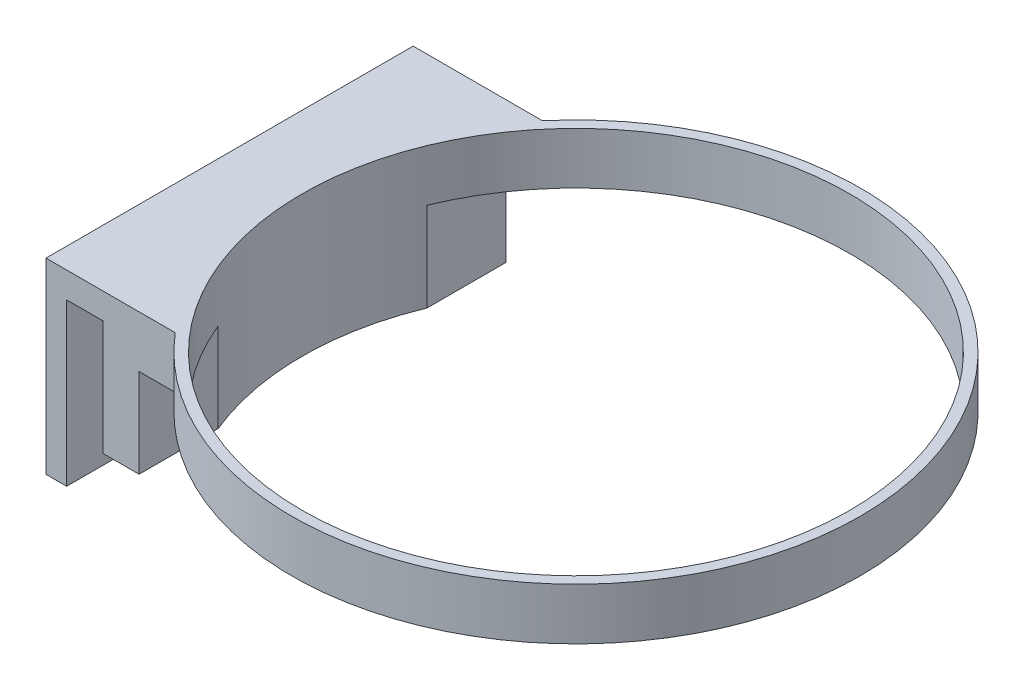
ISO-10303-21;
HEADER;
FILE_DESCRIPTION(('STEP AP214'),'2;1');
FILE_NAME('part.step','',(''),(''),'','','');
FILE_SCHEMA(('AUTOMOTIVE_DESIGN { 1 0 10303 214 1 1 1 1 }'));
ENDSEC;
DATA;
#1=APPLICATION_CONTEXT('core data for automotive mechanical design processes');
#2=APPLICATION_PROTOCOL_DEFINITION('international standard','automotive_design',2000,#1);
#3=PRODUCT_CONTEXT('',#1,'mechanical');
#4=PRODUCT('Part','Part','',(#3));
#5=PRODUCT_RELATED_PRODUCT_CATEGORY('part','',(#4));
#6=PRODUCT_DEFINITION_FORMATION('','',#4);
#7=PRODUCT_DEFINITION_CONTEXT('part definition',#1,'design');
#8=PRODUCT_DEFINITION('design','',#6,#7);
#9=PRODUCT_DEFINITION_SHAPE('','',#8);
#10=(LENGTH_UNIT() NAMED_UNIT(*) SI_UNIT(.MILLI.,.METRE.));
#11=(NAMED_UNIT(*) PLANE_ANGLE_UNIT() SI_UNIT($,.RADIAN.));
#12=(NAMED_UNIT(*) SI_UNIT($,.STERADIAN.) SOLID_ANGLE_UNIT());
#13=UNCERTAINTY_MEASURE_WITH_UNIT(LENGTH_MEASURE(1.E-05),#10,'distance_accuracy_value','');
#14=(GEOMETRIC_REPRESENTATION_CONTEXT(3) GLOBAL_UNCERTAINTY_ASSIGNED_CONTEXT((#13)) GLOBAL_UNIT_ASSIGNED_CONTEXT((#10,
#11,#12)) REPRESENTATION_CONTEXT('',''));
#15=CARTESIAN_POINT('',(0.,0.,0.));
#16=DIRECTION('',(0.,0.,1.));
#17=DIRECTION('',(1.,0.,0.));
#18=AXIS2_PLACEMENT_3D('',#15,#16,#17);
#19=CARTESIAN_POINT('',(-49.,0.,75.9647660154098));
#20=DIRECTION('',(1.,0.,0.));
#21=DIRECTION('',(0.,0.,-1.));
#22=AXIS2_PLACEMENT_3D('',#19,#20,#21);
#23=PLANE('',#22);
#24=DIRECTION('',(0.,1.,0.));
#25=VECTOR('',#24,1.);
#26=CARTESIAN_POINT('',(-49.,-167.123721477683,-20.1990098767242));
#27=LINE('',#26,#25);
#28=CARTESIAN_POINT('',(-49.,-17.2170838661349,-20.1990098767242));
#29=VERTEX_POINT('',#28);
#30=CARTESIAN_POINT('',(-49.,0.,-20.1990098767242));
#31=VERTEX_POINT('',#30);
#32=EDGE_CURVE('E13',#29,#31,#27,.T.);
#33=ORIENTED_EDGE('',*,*,#32,.F.);
#34=DIRECTION('',(0.,0.,-1.));
#35=VECTOR('',#34,1.);
#36=CARTESIAN_POINT('',(-49.,-17.2170838661349,75.9647660154098));
#37=LINE('',#36,#35);
#38=CARTESIAN_POINT('',(-49.,-17.2170838661349,-35.5105618091294));
#39=VERTEX_POINT('',#38);
#40=EDGE_CURVE('E150',#29,#39,#37,.T.);
#41=ORIENTED_EDGE('',*,*,#40,.T.);
#42=DIRECTION('',(0.,-1.,0.));
#43=VECTOR('',#42,1.);
#44=CARTESIAN_POINT('',(-49.,0.,-35.5105618091294));
#45=LINE('',#44,#43);
#46=CARTESIAN_POINT('',(-49.,0.,-35.5105618091294));
#47=VERTEX_POINT('',#46);
#48=EDGE_CURVE('E146',#47,#39,#45,.T.);
#49=ORIENTED_EDGE('',*,*,#48,.F.);
#50=DIRECTION('',(0.,0.,-1.));
#51=VECTOR('',#50,1.);
#52=CARTESIAN_POINT('',(-49.,0.,0.));
#53=LINE('',#52,#51);
#54=EDGE_CURVE('E64',#31,#47,#53,.T.);
#55=ORIENTED_EDGE('',*,*,#54,.F.);
#56=EDGE_LOOP('',(#33,#41,#49,#55));
#57=FACE_BOUND('',#56,.T.);
#58=ADVANCED_FACE('F49',(#57),#23,.T.);
#59=CARTESIAN_POINT('',(0.,10.,0.));
#60=DIRECTION('',(0.,1.,0.));
#61=DIRECTION('',(0.,0.,1.));
#62=AXIS2_PLACEMENT_3D('',#59,#60,#61);
#63=PLANE('',#62);
#64=CARTESIAN_POINT('',(0.,10.,0.));
#65=DIRECTION('',(0.,1.,0.));
#66=DIRECTION('',(0.,0.,1.));
#67=AXIS2_PLACEMENT_3D('',#64,#65,#66);
#68=CIRCLE('',#67,53.);
#69=CARTESIAN_POINT('',(0.,10.,53.));
#70=VERTEX_POINT('',#69);
#71=EDGE_CURVE('E173',#70,#70,#68,.T.);
#72=ORIENTED_EDGE('',*,*,#71,.F.);
#73=EDGE_LOOP('',(#72));
#74=FACE_BOUND('',#73,.T.);
#75=DIRECTION('',(1.,0.,0.));
#76=VECTOR('',#75,1.);
#77=CARTESIAN_POINT('',(-42.,10.,35.5105618091294));
#78=LINE('',#77,#76);
#79=CARTESIAN_POINT('',(-67.,10.,35.5105618091294));
#80=VERTEX_POINT('',#79);
#81=CARTESIAN_POINT('',(-42.,10.,35.5105618091294));
#82=VERTEX_POINT('',#81);
#83=EDGE_CURVE('E185',#80,#82,#78,.T.);
#84=ORIENTED_EDGE('',*,*,#83,.T.);
#85=CARTESIAN_POINT('',(0.,10.,0.));
#86=DIRECTION('',(0.,1.,0.));
#87=DIRECTION('',(0.,0.,1.));
#88=AXIS2_PLACEMENT_3D('',#85,#86,#87);
#89=CIRCLE('',#88,55.);
#90=CARTESIAN_POINT('',(-42.,10.,-35.5105618091294));
#91=VERTEX_POINT('',#90);
#92=EDGE_CURVE('E179',#82,#91,#89,.T.);
#93=ORIENTED_EDGE('',*,*,#92,.T.);
#94=DIRECTION('',(-1.,0.,0.));
#95=VECTOR('',#94,1.);
#96=CARTESIAN_POINT('',(-42.,10.,-35.5105618091294));
#97=LINE('',#96,#95);
#98=CARTESIAN_POINT('',(-67.,10.,-35.5105618091294));
#99=VERTEX_POINT('',#98);
#100=EDGE_CURVE('E182',#91,#99,#97,.T.);
#101=ORIENTED_EDGE('',*,*,#100,.T.);
#102=DIRECTION('',(0.,0.,-1.));
#103=VECTOR('',#102,1.);
#104=CARTESIAN_POINT('',(-67.,10.,75.9647660154098));
#105=LINE('',#104,#103);
#106=EDGE_CURVE('E221',#80,#99,#105,.T.);
#107=ORIENTED_EDGE('',*,*,#106,.F.);
#108=EDGE_LOOP('',(#84,#93,#101,#107));
#109=FACE_BOUND('',#108,.T.);
#110=ADVANCED_FACE('F258',(#74,#109),#63,.T.);
#111=CARTESIAN_POINT('',(0.,0.,0.));
#112=DIRECTION('',(0.,1.,0.));
#113=DIRECTION('',(0.,0.,1.));
#114=AXIS2_PLACEMENT_3D('',#111,#112,#113);
#115=PLANE('',#114);
#116=DIRECTION('',(1.,0.,0.));
#117=VECTOR('',#116,1.);
#118=CARTESIAN_POINT('',(-42.,0.,35.5105618091294));
#119=LINE('',#118,#117);
#120=CARTESIAN_POINT('',(-49.,0.,35.5105618091294));
#121=VERTEX_POINT('',#120);
#122=CARTESIAN_POINT('',(-42.,0.,35.5105618091294));
#123=VERTEX_POINT('',#122);
#124=EDGE_CURVE('E183',#121,#123,#119,.T.);
#125=ORIENTED_EDGE('',*,*,#124,.F.);
#126=CARTESIAN_POINT('',(-49.,0.,20.1990098767242));
#127=VERTEX_POINT('',#126);
#128=EDGE_CURVE('E172',#121,#127,#53,.T.);
#129=ORIENTED_EDGE('',*,*,#128,.T.);
#130=CARTESIAN_POINT('',(0.,0.,0.));
#131=DIRECTION('',(0.,1.,0.));
#132=DIRECTION('',(0.,0.,1.));
#133=AXIS2_PLACEMENT_3D('',#130,#131,#132);
#134=CIRCLE('',#133,53.);
#135=EDGE_CURVE('E177',#127,#31,#134,.T.);
#136=ORIENTED_EDGE('',*,*,#135,.T.);
#137=ORIENTED_EDGE('',*,*,#54,.T.);
#138=DIRECTION('',(-1.,0.,0.));
#139=VECTOR('',#138,1.);
#140=CARTESIAN_POINT('',(-42.,0.,-35.5105618091294));
#141=LINE('',#140,#139);
#142=CARTESIAN_POINT('',(-42.,0.,-35.5105618091294));
#143=VERTEX_POINT('',#142);
#144=EDGE_CURVE('E190',#143,#47,#141,.T.);
#145=ORIENTED_EDGE('',*,*,#144,.F.);
#146=CARTESIAN_POINT('',(0.,0.,0.));
#147=DIRECTION('',(0.,1.,0.));
#148=DIRECTION('',(0.,0.,1.));
#149=AXIS2_PLACEMENT_3D('',#146,#147,#148);
#150=CIRCLE('',#149,55.);
#151=EDGE_CURVE('E176',#123,#143,#150,.T.);
#152=ORIENTED_EDGE('',*,*,#151,.F.);
#153=EDGE_LOOP('',(#125,#129,#136,#137,#145,#152));
#154=FACE_BOUND('',#153,.T.);
#155=ADVANCED_FACE('F208',(#154),#115,.F.);
#156=CARTESIAN_POINT('',(0.,10.,0.));
#157=DIRECTION('',(0.,-1.,0.));
#158=DIRECTION('',(0.,0.,-1.));
#159=AXIS2_PLACEMENT_3D('',#156,#157,#158);
#160=CYLINDRICAL_SURFACE('',#159,55.);
#161=ORIENTED_EDGE('',*,*,#151,.T.);
#162=DIRECTION('',(0.,-1.,0.));
#163=VECTOR('',#162,1.);
#164=CARTESIAN_POINT('',(-42.,10.,-35.5105618091294));
#165=LINE('',#164,#163);
#166=EDGE_CURVE('E199',#91,#143,#165,.T.);
#167=ORIENTED_EDGE('',*,*,#166,.F.);
#168=ORIENTED_EDGE('',*,*,#92,.F.);
#169=DIRECTION('',(0.,-1.,0.));
#170=VECTOR('',#169,1.);
#171=CARTESIAN_POINT('',(-42.,10.,35.5105618091294));
#172=LINE('',#171,#170);
#173=EDGE_CURVE('E187',#82,#123,#172,.T.);
#174=ORIENTED_EDGE('',*,*,#173,.T.);
#175=EDGE_LOOP('',(#161,#167,#168,#174));
#176=FACE_BOUND('',#175,.T.);
#177=ADVANCED_FACE('F51',(#176),#160,.T.);
#178=CARTESIAN_POINT('',(-42.,10.,-35.5105618091294));
#179=DIRECTION('',(0.,0.,1.));
#180=DIRECTION('',(1.,0.,0.));
#181=AXIS2_PLACEMENT_3D('',#178,#179,#180);
#182=PLANE('',#181);
#183=ORIENTED_EDGE('',*,*,#144,.T.);
#184=ORIENTED_EDGE('',*,*,#48,.T.);
#185=DIRECTION('',(-1.,0.,0.));
#186=VECTOR('',#185,1.);
#187=CARTESIAN_POINT('',(-49.,-17.2170838661349,-35.5105618091294));
#188=LINE('',#187,#186);
#189=CARTESIAN_POINT('',(-56.,-17.2170838661349,-35.5105618091294));
#190=VERTEX_POINT('',#189);
#191=EDGE_CURVE('E156',#39,#190,#188,.T.);
#192=ORIENTED_EDGE('',*,*,#191,.T.);
#193=DIRECTION('',(0.,-1.,0.));
#194=VECTOR('',#193,1.);
#195=CARTESIAN_POINT('',(-56.,10.,-35.5105618091294));
#196=LINE('',#195,#194);
#197=CARTESIAN_POINT('',(-56.,5.,-35.5105618091294));
#198=VERTEX_POINT('',#197);
#199=EDGE_CURVE('E197',#198,#190,#196,.T.);
#200=ORIENTED_EDGE('',*,*,#199,.F.);
#201=DIRECTION('',(-1.,0.,0.));
#202=VECTOR('',#201,1.);
#203=CARTESIAN_POINT('',(-56.,5.,-35.5105618091294));
#204=LINE('',#203,#202);
#205=CARTESIAN_POINT('',(-63.,5.,-35.5105618091294));
#206=VERTEX_POINT('',#205);
#207=EDGE_CURVE('E235',#198,#206,#204,.T.);
#208=ORIENTED_EDGE('',*,*,#207,.T.);
#209=DIRECTION('',(0.,-1.,0.));
#210=VECTOR('',#209,1.);
#211=CARTESIAN_POINT('',(-63.,5.,-35.5105618091294));
#212=LINE('',#211,#210);
#213=CARTESIAN_POINT('',(-63.,-26.2290303204962,-35.5105618091294));
#214=VERTEX_POINT('',#213);
#215=EDGE_CURVE('E238',#206,#214,#212,.T.);
#216=ORIENTED_EDGE('',*,*,#215,.T.);
#217=DIRECTION('',(-1.,0.,0.));
#218=VECTOR('',#217,1.);
#219=CARTESIAN_POINT('',(-63.,-26.2290303204962,-35.5105618091294));
#220=LINE('',#219,#218);
#221=CARTESIAN_POINT('',(-67.,-26.2290303204962,-35.5105618091294));
#222=VERTEX_POINT('',#221);
#223=EDGE_CURVE('E162',#214,#222,#220,.T.);
#224=ORIENTED_EDGE('',*,*,#223,.T.);
#225=DIRECTION('',(0.,1.,0.));
#226=VECTOR('',#225,1.);
#227=CARTESIAN_POINT('',(-67.,-26.2290303204962,-35.5105618091294));
#228=LINE('',#227,#226);
#229=EDGE_CURVE('E158',#222,#99,#228,.T.);
#230=ORIENTED_EDGE('',*,*,#229,.T.);
#231=ORIENTED_EDGE('',*,*,#100,.F.);
#232=ORIENTED_EDGE('',*,*,#166,.T.);
#233=EDGE_LOOP('',(#183,#184,#192,#200,#208,#216,#224,#230,#231,#232));
#234=FACE_BOUND('',#233,.T.);
#235=ADVANCED_FACE('F203',(#234),#182,.F.);
#236=CARTESIAN_POINT('',(-56.,10.,-35.5105618091294));
#237=DIRECTION('',(1.,0.,0.));
#238=DIRECTION('',(0.,0.,-1.));
#239=AXIS2_PLACEMENT_3D('',#236,#237,#238);
#240=PLANE('',#239);
#241=DIRECTION('',(0.,-1.,0.));
#242=VECTOR('',#241,1.);
#243=CARTESIAN_POINT('',(-56.,10.,35.5105618091294));
#244=LINE('',#243,#242);
#245=CARTESIAN_POINT('',(-56.,5.,35.5105618091294));
#246=VERTEX_POINT('',#245);
#247=CARTESIAN_POINT('',(-56.,-17.2170838661349,35.5105618091294));
#248=VERTEX_POINT('',#247);
#249=EDGE_CURVE('E195',#246,#248,#244,.T.);
#250=ORIENTED_EDGE('',*,*,#249,.F.);
#251=DIRECTION('',(0.,0.,-1.));
#252=VECTOR('',#251,1.);
#253=CARTESIAN_POINT('',(-56.,5.,75.9647660154098));
#254=LINE('',#253,#252);
#255=EDGE_CURVE('E72',#246,#198,#254,.T.);
#256=ORIENTED_EDGE('',*,*,#255,.T.);
#257=ORIENTED_EDGE('',*,*,#199,.T.);
#258=DIRECTION('',(0.,0.,-1.));
#259=VECTOR('',#258,1.);
#260=CARTESIAN_POINT('',(-56.,-17.2170838661349,75.9647660154098));
#261=LINE('',#260,#259);
#262=EDGE_CURVE('E160',#248,#190,#261,.T.);
#263=ORIENTED_EDGE('',*,*,#262,.F.);
#264=EDGE_LOOP('',(#250,#256,#257,#263));
#265=FACE_BOUND('',#264,.T.);
#266=ADVANCED_FACE('F249',(#265),#240,.F.);
#267=CARTESIAN_POINT('',(-42.,10.,35.5105618091294));
#268=DIRECTION('',(0.,0.,-1.));
#269=DIRECTION('',(-1.,0.,0.));
#270=AXIS2_PLACEMENT_3D('',#267,#268,#269);
#271=PLANE('',#270);
#272=ORIENTED_EDGE('',*,*,#173,.F.);
#273=ORIENTED_EDGE('',*,*,#83,.F.);
#274=DIRECTION('',(0.,-1.,0.));
#275=VECTOR('',#274,1.);
#276=CARTESIAN_POINT('',(-67.,-26.2290303204962,35.5105618091294));
#277=LINE('',#276,#275);
#278=CARTESIAN_POINT('',(-67.,-26.2290303204962,35.5105618091294));
#279=VERTEX_POINT('',#278);
#280=EDGE_CURVE('E170',#80,#279,#277,.T.);
#281=ORIENTED_EDGE('',*,*,#280,.T.);
#282=DIRECTION('',(1.,0.,0.));
#283=VECTOR('',#282,1.);
#284=CARTESIAN_POINT('',(-63.,-26.2290303204962,35.5105618091294));
#285=LINE('',#284,#283);
#286=CARTESIAN_POINT('',(-63.,-26.2290303204962,35.5105618091294));
#287=VERTEX_POINT('',#286);
#288=EDGE_CURVE('E230',#279,#287,#285,.T.);
#289=ORIENTED_EDGE('',*,*,#288,.T.);
#290=DIRECTION('',(0.,1.,0.));
#291=VECTOR('',#290,1.);
#292=CARTESIAN_POINT('',(-63.,5.,35.5105618091294));
#293=LINE('',#292,#291);
#294=CARTESIAN_POINT('',(-63.,5.,35.5105618091294));
#295=VERTEX_POINT('',#294);
#296=EDGE_CURVE('E223',#287,#295,#293,.T.);
#297=ORIENTED_EDGE('',*,*,#296,.T.);
#298=DIRECTION('',(1.,0.,0.));
#299=VECTOR('',#298,1.);
#300=CARTESIAN_POINT('',(-56.,5.,35.5105618091294));
#301=LINE('',#300,#299);
#302=EDGE_CURVE('E220',#295,#246,#301,.T.);
#303=ORIENTED_EDGE('',*,*,#302,.T.);
#304=ORIENTED_EDGE('',*,*,#249,.T.);
#305=DIRECTION('',(1.,0.,0.));
#306=VECTOR('',#305,1.);
#307=CARTESIAN_POINT('',(-49.,-17.2170838661349,35.5105618091294));
#308=LINE('',#307,#306);
#309=CARTESIAN_POINT('',(-49.,-17.2170838661349,35.5105618091294));
#310=VERTEX_POINT('',#309);
#311=EDGE_CURVE('E217',#248,#310,#308,.T.);
#312=ORIENTED_EDGE('',*,*,#311,.T.);
#313=DIRECTION('',(0.,1.,0.));
#314=VECTOR('',#313,1.);
#315=CARTESIAN_POINT('',(-49.,0.,35.5105618091294));
#316=LINE('',#315,#314);
#317=EDGE_CURVE('E167',#310,#121,#316,.T.);
#318=ORIENTED_EDGE('',*,*,#317,.T.);
#319=ORIENTED_EDGE('',*,*,#124,.T.);
#320=EDGE_LOOP('',(#272,#273,#281,#289,#297,#303,#304,#312,#318,#319));
#321=FACE_BOUND('',#320,.T.);
#322=ADVANCED_FACE('F215',(#321),#271,.F.);
#323=CARTESIAN_POINT('',(0.,10.,0.));
#324=DIRECTION('',(0.,-1.,0.));
#325=DIRECTION('',(0.,0.,-1.));
#326=AXIS2_PLACEMENT_3D('',#323,#324,#325);
#327=CYLINDRICAL_SURFACE('',#326,53.);
#328=ORIENTED_EDGE('',*,*,#71,.T.);
#329=EDGE_LOOP('',(#328));
#330=FACE_BOUND('',#329,.T.);
#331=ORIENTED_EDGE('',*,*,#135,.F.);
#332=DIRECTION('',(0.,1.,0.));
#333=VECTOR('',#332,1.);
#334=CARTESIAN_POINT('',(-49.,-167.123721477683,20.1990098767242));
#335=LINE('',#334,#333);
#336=CARTESIAN_POINT('',(-49.,-17.2170838661349,20.1990098767242));
#337=VERTEX_POINT('',#336);
#338=EDGE_CURVE('E57',#127,#337,#335,.F.);
#339=ORIENTED_EDGE('',*,*,#338,.T.);
#340=CARTESIAN_POINT('',(0.,-17.2170838661349,0.));
#341=DIRECTION('',(0.,-1.,0.));
#342=DIRECTION('',(0.,0.,-1.));
#343=AXIS2_PLACEMENT_3D('',#340,#341,#342);
#344=CIRCLE('',#343,53.);
#345=EDGE_CURVE('E138',#29,#337,#344,.F.);
#346=ORIENTED_EDGE('',*,*,#345,.F.);
#347=ORIENTED_EDGE('',*,*,#32,.T.);
#348=EDGE_LOOP('',(#331,#339,#346,#347));
#349=FACE_BOUND('',#348,.T.);
#350=ADVANCED_FACE('F141',(#330,#349),#327,.F.);
#351=CARTESIAN_POINT('',(-49.,-17.2170838661349,75.9647660154098));
#352=DIRECTION('',(0.,-1.,0.));
#353=DIRECTION('',(0.,0.,-1.));
#354=AXIS2_PLACEMENT_3D('',#351,#352,#353);
#355=PLANE('',#354);
#356=ORIENTED_EDGE('',*,*,#345,.T.);
#357=EDGE_CURVE('E157',#310,#337,#37,.T.);
#358=ORIENTED_EDGE('',*,*,#357,.F.);
#359=ORIENTED_EDGE('',*,*,#311,.F.);
#360=ORIENTED_EDGE('',*,*,#262,.T.);
#361=ORIENTED_EDGE('',*,*,#191,.F.);
#362=ORIENTED_EDGE('',*,*,#40,.F.);
#363=EDGE_LOOP('',(#356,#358,#359,#360,#361,#362));
#364=FACE_BOUND('',#363,.T.);
#365=ADVANCED_FACE('F153',(#364),#355,.T.);
#366=ORIENTED_EDGE('',*,*,#338,.F.);
#367=ORIENTED_EDGE('',*,*,#128,.F.);
#368=ORIENTED_EDGE('',*,*,#317,.F.);
#369=ORIENTED_EDGE('',*,*,#357,.T.);
#370=EDGE_LOOP('',(#366,#367,#368,#369));
#371=FACE_BOUND('',#370,.T.);
#372=ADVANCED_FACE('F214',(#371),#23,.T.);
#373=CARTESIAN_POINT('',(-67.,-26.2290303204962,75.9647660154098));
#374=DIRECTION('',(-1.,0.,0.));
#375=DIRECTION('',(0.,0.,1.));
#376=AXIS2_PLACEMENT_3D('',#373,#374,#375);
#377=PLANE('',#376);
#378=ORIENTED_EDGE('',*,*,#280,.F.);
#379=ORIENTED_EDGE('',*,*,#106,.T.);
#380=ORIENTED_EDGE('',*,*,#229,.F.);
#381=DIRECTION('',(0.,0.,-1.));
#382=VECTOR('',#381,1.);
#383=CARTESIAN_POINT('',(-67.,-26.2290303204962,75.9647660154098));
#384=LINE('',#383,#382);
#385=EDGE_CURVE('E226',#279,#222,#384,.T.);
#386=ORIENTED_EDGE('',*,*,#385,.F.);
#387=EDGE_LOOP('',(#378,#379,#380,#386));
#388=FACE_BOUND('',#387,.T.);
#389=ADVANCED_FACE('F269',(#388),#377,.T.);
#390=CARTESIAN_POINT('',(-63.,-26.2290303204962,75.9647660154098));
#391=DIRECTION('',(0.,-1.,0.));
#392=DIRECTION('',(0.,0.,-1.));
#393=AXIS2_PLACEMENT_3D('',#390,#391,#392);
#394=PLANE('',#393);
#395=ORIENTED_EDGE('',*,*,#288,.F.);
#396=ORIENTED_EDGE('',*,*,#385,.T.);
#397=ORIENTED_EDGE('',*,*,#223,.F.);
#398=DIRECTION('',(0.,0.,-1.));
#399=VECTOR('',#398,1.);
#400=CARTESIAN_POINT('',(-63.,-26.2290303204962,75.9647660154098));
#401=LINE('',#400,#399);
#402=EDGE_CURVE('E244',#287,#214,#401,.T.);
#403=ORIENTED_EDGE('',*,*,#402,.F.);
#404=EDGE_LOOP('',(#395,#396,#397,#403));
#405=FACE_BOUND('',#404,.T.);
#406=ADVANCED_FACE('F274',(#405),#394,.T.);
#407=CARTESIAN_POINT('',(-63.,5.,75.9647660154098));
#408=DIRECTION('',(1.,0.,0.));
#409=DIRECTION('',(0.,0.,-1.));
#410=AXIS2_PLACEMENT_3D('',#407,#408,#409);
#411=PLANE('',#410);
#412=ORIENTED_EDGE('',*,*,#296,.F.);
#413=ORIENTED_EDGE('',*,*,#402,.T.);
#414=ORIENTED_EDGE('',*,*,#215,.F.);
#415=DIRECTION('',(0.,0.,-1.));
#416=VECTOR('',#415,1.);
#417=CARTESIAN_POINT('',(-63.,5.,75.9647660154098));
#418=LINE('',#417,#416);
#419=EDGE_CURVE('E246',#295,#206,#418,.T.);
#420=ORIENTED_EDGE('',*,*,#419,.F.);
#421=EDGE_LOOP('',(#412,#413,#414,#420));
#422=FACE_BOUND('',#421,.T.);
#423=ADVANCED_FACE('F285',(#422),#411,.T.);
#424=CARTESIAN_POINT('',(-56.,5.,75.9647660154098));
#425=DIRECTION('',(0.,-1.,0.));
#426=DIRECTION('',(1.,0.,0.));
#427=AXIS2_PLACEMENT_3D('',#424,#425,#426);
#428=PLANE('',#427);
#429=ORIENTED_EDGE('',*,*,#302,.F.);
#430=ORIENTED_EDGE('',*,*,#419,.T.);
#431=ORIENTED_EDGE('',*,*,#207,.F.);
#432=ORIENTED_EDGE('',*,*,#255,.F.);
#433=EDGE_LOOP('',(#429,#430,#431,#432));
#434=FACE_BOUND('',#433,.T.);
#435=ADVANCED_FACE('F282',(#434),#428,.T.);
#436=CLOSED_SHELL('',(#58,#110,#155,#177,#235,#266,#322,#350,#365,#372,#389,#406,#423,#435));
#437=MANIFOLD_SOLID_BREP('B2',#436);
#438=ADVANCED_BREP_SHAPE_REPRESENTATION('',(#18,#437),#14);
#439=SHAPE_DEFINITION_REPRESENTATION(#9,#438);
ENDSEC;
END-ISO-10303-21;
